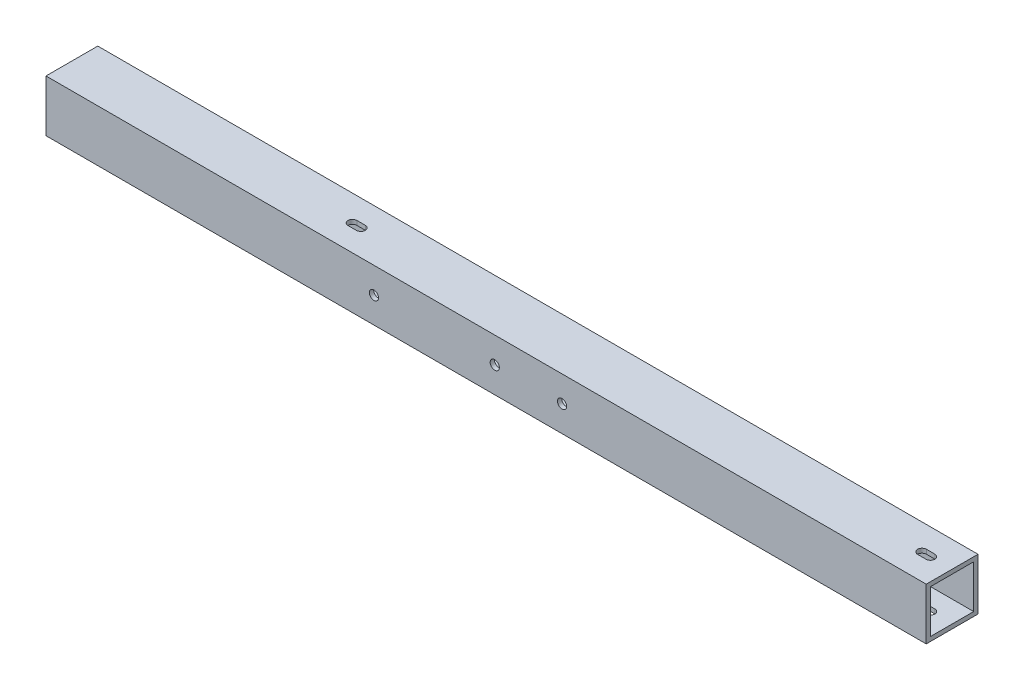
ISO-10303-21;
HEADER;
FILE_DESCRIPTION(('STEP AP214'),'2;1');
FILE_NAME('part.step','',(''),(''),'','','');
FILE_SCHEMA(('AUTOMOTIVE_DESIGN { 1 0 10303 214 1 1 1 1 }'));
ENDSEC;
DATA;
#1=APPLICATION_CONTEXT('core data for automotive mechanical design processes');
#2=APPLICATION_PROTOCOL_DEFINITION('international standard','automotive_design',2000,#1);
#3=PRODUCT_CONTEXT('',#1,'mechanical');
#4=PRODUCT('Part','Part','',(#3));
#5=PRODUCT_RELATED_PRODUCT_CATEGORY('part','',(#4));
#6=PRODUCT_DEFINITION_FORMATION('','',#4);
#7=PRODUCT_DEFINITION_CONTEXT('part definition',#1,'design');
#8=PRODUCT_DEFINITION('design','',#6,#7);
#9=PRODUCT_DEFINITION_SHAPE('','',#8);
#10=(LENGTH_UNIT() NAMED_UNIT(*) SI_UNIT(.MILLI.,.METRE.));
#11=(NAMED_UNIT(*) PLANE_ANGLE_UNIT() SI_UNIT($,.RADIAN.));
#12=(NAMED_UNIT(*) SI_UNIT($,.STERADIAN.) SOLID_ANGLE_UNIT());
#13=UNCERTAINTY_MEASURE_WITH_UNIT(LENGTH_MEASURE(1.E-05),#10,'distance_accuracy_value','');
#14=(GEOMETRIC_REPRESENTATION_CONTEXT(3) GLOBAL_UNCERTAINTY_ASSIGNED_CONTEXT((#13)) GLOBAL_UNIT_ASSIGNED_CONTEXT((#10,
#11,#12)) REPRESENTATION_CONTEXT('',''));
#15=CARTESIAN_POINT('',(0.,0.,0.));
#16=DIRECTION('',(0.,0.,1.));
#17=DIRECTION('',(1.,0.,0.));
#18=AXIS2_PLACEMENT_3D('',#15,#16,#17);
#19=CARTESIAN_POINT('',(-723.9,38.1,-38.1));
#20=DIRECTION('',(0.,-1.,0.));
#21=DIRECTION('',(0.,0.,-1.));
#22=AXIS2_PLACEMENT_3D('',#19,#20,#21);
#23=PLANE('',#22);
#24=DIRECTION('',(1.,0.,0.));
#25=VECTOR('',#24,1.);
#26=CARTESIAN_POINT('',(-479.3361,38.1,-22.3139));
#27=LINE('',#26,#25);
#28=CARTESIAN_POINT('',(-479.3361,38.1,-22.3139));
#29=VERTEX_POINT('',#28);
#30=CARTESIAN_POINT('',(-473.1639,38.1,-22.3139));
#31=VERTEX_POINT('',#30);
#32=EDGE_CURVE('E216',#29,#31,#27,.T.);
#33=ORIENTED_EDGE('',*,*,#32,.T.);
#34=CARTESIAN_POINT('',(-473.1639,38.1,-19.05));
#35=DIRECTION('',(0.,-1.,0.));
#36=DIRECTION('',(0.,0.,-1.));
#37=AXIS2_PLACEMENT_3D('',#34,#35,#36);
#38=CIRCLE('',#37,3.26389999999999);
#39=CARTESIAN_POINT('',(-473.1639,38.1,-15.7861));
#40=VERTEX_POINT('',#39);
#41=EDGE_CURVE('E233',#31,#40,#38,.T.);
#42=ORIENTED_EDGE('',*,*,#41,.T.);
#43=DIRECTION('',(1.,0.,0.));
#44=VECTOR('',#43,1.);
#45=CARTESIAN_POINT('',(-479.3361,38.1,-15.7861));
#46=LINE('',#45,#44);
#47=CARTESIAN_POINT('',(-479.3361,38.1,-15.7861));
#48=VERTEX_POINT('',#47);
#49=EDGE_CURVE('E224',#48,#40,#46,.T.);
#50=ORIENTED_EDGE('',*,*,#49,.F.);
#51=CARTESIAN_POINT('',(-479.3361,38.1,-19.05));
#52=DIRECTION('',(0.,-1.,0.));
#53=DIRECTION('',(0.,0.,-1.));
#54=AXIS2_PLACEMENT_3D('',#51,#52,#53);
#55=CIRCLE('',#54,3.26389999999999);
#56=EDGE_CURVE('E226',#48,#29,#55,.T.);
#57=ORIENTED_EDGE('',*,*,#56,.T.);
#58=EDGE_LOOP('',(#33,#42,#50,#57));
#59=FACE_BOUND('',#58,.T.);
#60=DIRECTION('',(0.,0.,1.));
#61=VECTOR('',#60,1.);
#62=CARTESIAN_POINT('',(-38.1,38.1,-38.1));
#63=LINE('',#62,#61);
#64=CARTESIAN_POINT('',(-38.1,38.1,-38.1));
#65=VERTEX_POINT('',#64);
#66=CARTESIAN_POINT('',(-38.1,38.1,0.));
#67=VERTEX_POINT('',#66);
#68=EDGE_CURVE('E305',#65,#67,#63,.T.);
#69=ORIENTED_EDGE('',*,*,#68,.F.);
#70=DIRECTION('',(1.,0.,0.));
#71=VECTOR('',#70,1.);
#72=CARTESIAN_POINT('',(-723.9,38.1,-38.1));
#73=LINE('',#72,#71);
#74=CARTESIAN_POINT('',(-685.8,38.1,-38.1));
#75=VERTEX_POINT('',#74);
#76=EDGE_CURVE('E342',#75,#65,#73,.T.);
#77=ORIENTED_EDGE('',*,*,#76,.F.);
#78=DIRECTION('',(0.,0.,-1.));
#79=VECTOR('',#78,1.);
#80=CARTESIAN_POINT('',(-685.8,38.1,-38.1));
#81=LINE('',#80,#79);
#82=CARTESIAN_POINT('',(-685.8,38.1,0.));
#83=VERTEX_POINT('',#82);
#84=EDGE_CURVE('E321',#83,#75,#81,.T.);
#85=ORIENTED_EDGE('',*,*,#84,.F.);
#86=DIRECTION('',(1.,0.,0.));
#87=VECTOR('',#86,1.);
#88=CARTESIAN_POINT('',(-723.9,38.1,0.));
#89=LINE('',#88,#87);
#90=EDGE_CURVE('E345',#83,#67,#89,.T.);
#91=ORIENTED_EDGE('',*,*,#90,.T.);
#92=EDGE_LOOP('',(#69,#77,#85,#91));
#93=FACE_BOUND('',#92,.T.);
#94=DIRECTION('',(1.,0.,0.));
#95=VECTOR('',#94,1.);
#96=CARTESIAN_POINT('',(-60.2361,38.1,-15.7861));
#97=LINE('',#96,#95);
#98=CARTESIAN_POINT('',(-60.2361,38.1,-15.7861));
#99=VERTEX_POINT('',#98);
#100=CARTESIAN_POINT('',(-54.0639,38.1,-15.7861));
#101=VERTEX_POINT('',#100);
#102=EDGE_CURVE('E248',#99,#101,#97,.T.);
#103=ORIENTED_EDGE('',*,*,#102,.F.);
#104=CARTESIAN_POINT('',(-60.2361,38.1,-19.05));
#105=DIRECTION('',(0.,-1.,0.));
#106=DIRECTION('',(0.,0.,-1.));
#107=AXIS2_PLACEMENT_3D('',#104,#105,#106);
#108=CIRCLE('',#107,3.26389999999999);
#109=CARTESIAN_POINT('',(-60.2361,38.1,-22.3139));
#110=VERTEX_POINT('',#109);
#111=EDGE_CURVE('E250',#99,#110,#108,.T.);
#112=ORIENTED_EDGE('',*,*,#111,.T.);
#113=DIRECTION('',(1.,0.,0.));
#114=VECTOR('',#113,1.);
#115=CARTESIAN_POINT('',(-60.2361,38.1,-22.3139));
#116=LINE('',#115,#114);
#117=CARTESIAN_POINT('',(-54.0639,38.1,-22.3139));
#118=VERTEX_POINT('',#117);
#119=EDGE_CURVE('E244',#110,#118,#116,.T.);
#120=ORIENTED_EDGE('',*,*,#119,.T.);
#121=CARTESIAN_POINT('',(-54.0639,38.1,-19.05));
#122=DIRECTION('',(0.,-1.,0.));
#123=DIRECTION('',(0.,0.,-1.));
#124=AXIS2_PLACEMENT_3D('',#121,#122,#123);
#125=CIRCLE('',#124,3.26389999999999);
#126=EDGE_CURVE('E251',#118,#101,#125,.T.);
#127=ORIENTED_EDGE('',*,*,#126,.T.);
#128=EDGE_LOOP('',(#103,#112,#120,#127));
#129=FACE_BOUND('',#128,.T.);
#130=ADVANCED_FACE('F33',(#59,#93,#129),#23,.F.);
#131=CARTESIAN_POINT('',(-723.9,0.,-38.1));
#132=DIRECTION('',(0.,1.,0.));
#133=DIRECTION('',(0.,0.,1.));
#134=AXIS2_PLACEMENT_3D('',#131,#132,#133);
#135=PLANE('',#134);
#136=CARTESIAN_POINT('',(-473.1639,0.,-19.05));
#137=DIRECTION('',(0.,-1.,0.));
#138=DIRECTION('',(0.,0.,-1.));
#139=AXIS2_PLACEMENT_3D('',#136,#137,#138);
#140=CIRCLE('',#139,3.26389999999999);
#141=CARTESIAN_POINT('',(-473.1639,0.,-22.3139));
#142=VERTEX_POINT('',#141);
#143=CARTESIAN_POINT('',(-473.1639,0.,-15.7861));
#144=VERTEX_POINT('',#143);
#145=EDGE_CURVE('E205',#142,#144,#140,.T.);
#146=ORIENTED_EDGE('',*,*,#145,.F.);
#147=DIRECTION('',(1.,0.,0.));
#148=VECTOR('',#147,1.);
#149=CARTESIAN_POINT('',(-479.3361,0.,-22.3139));
#150=LINE('',#149,#148);
#151=CARTESIAN_POINT('',(-479.3361,0.,-22.3139));
#152=VERTEX_POINT('',#151);
#153=EDGE_CURVE('E221',#152,#142,#150,.T.);
#154=ORIENTED_EDGE('',*,*,#153,.F.);
#155=CARTESIAN_POINT('',(-479.3361,0.,-19.05));
#156=DIRECTION('',(0.,-1.,0.));
#157=DIRECTION('',(0.,0.,-1.));
#158=AXIS2_PLACEMENT_3D('',#155,#156,#157);
#159=CIRCLE('',#158,3.26389999999999);
#160=CARTESIAN_POINT('',(-479.3361,0.,-15.7861));
#161=VERTEX_POINT('',#160);
#162=EDGE_CURVE('E215',#161,#152,#159,.T.);
#163=ORIENTED_EDGE('',*,*,#162,.F.);
#164=DIRECTION('',(1.,0.,0.));
#165=VECTOR('',#164,1.);
#166=CARTESIAN_POINT('',(-479.3361,0.,-15.7861));
#167=LINE('',#166,#165);
#168=EDGE_CURVE('E199',#161,#144,#167,.T.);
#169=ORIENTED_EDGE('',*,*,#168,.T.);
#170=EDGE_LOOP('',(#146,#154,#163,#169));
#171=FACE_BOUND('',#170,.T.);
#172=CARTESIAN_POINT('',(-54.0639,0.,-19.05));
#173=DIRECTION('',(0.,-1.,0.));
#174=DIRECTION('',(0.,0.,-1.));
#175=AXIS2_PLACEMENT_3D('',#172,#173,#174);
#176=CIRCLE('',#175,3.26389999999999);
#177=CARTESIAN_POINT('',(-54.0639,0.,-22.3139));
#178=VERTEX_POINT('',#177);
#179=CARTESIAN_POINT('',(-54.0639000000001,0.,-15.7861));
#180=VERTEX_POINT('',#179);
#181=EDGE_CURVE('E268',#178,#180,#176,.T.);
#182=ORIENTED_EDGE('',*,*,#181,.F.);
#183=DIRECTION('',(1.,0.,0.));
#184=VECTOR('',#183,1.);
#185=CARTESIAN_POINT('',(-60.2361,0.,-22.3139));
#186=LINE('',#185,#184);
#187=CARTESIAN_POINT('',(-60.2361,0.,-22.3139));
#188=VERTEX_POINT('',#187);
#189=EDGE_CURVE('E242',#188,#178,#186,.T.);
#190=ORIENTED_EDGE('',*,*,#189,.F.);
#191=CARTESIAN_POINT('',(-60.2361,0.,-19.05));
#192=DIRECTION('',(0.,-1.,0.));
#193=DIRECTION('',(0.,0.,-1.));
#194=AXIS2_PLACEMENT_3D('',#191,#192,#193);
#195=CIRCLE('',#194,3.26389999999999);
#196=CARTESIAN_POINT('',(-60.2361,0.,-15.7861));
#197=VERTEX_POINT('',#196);
#198=EDGE_CURVE('E254',#197,#188,#195,.T.);
#199=ORIENTED_EDGE('',*,*,#198,.F.);
#200=DIRECTION('',(1.,0.,0.));
#201=VECTOR('',#200,1.);
#202=CARTESIAN_POINT('',(-60.2361,0.,-15.7861));
#203=LINE('',#202,#201);
#204=EDGE_CURVE('E247',#197,#180,#203,.T.);
#205=ORIENTED_EDGE('',*,*,#204,.T.);
#206=EDGE_LOOP('',(#182,#190,#199,#205));
#207=FACE_BOUND('',#206,.T.);
#208=DIRECTION('',(0.,0.,-1.));
#209=VECTOR('',#208,1.);
#210=CARTESIAN_POINT('',(-38.1,0.,-38.1));
#211=LINE('',#210,#209);
#212=CARTESIAN_POINT('',(-38.1,0.,0.));
#213=VERTEX_POINT('',#212);
#214=CARTESIAN_POINT('',(-38.1,0.,-38.1));
#215=VERTEX_POINT('',#214);
#216=EDGE_CURVE('E303',#213,#215,#211,.T.);
#217=ORIENTED_EDGE('',*,*,#216,.F.);
#218=DIRECTION('',(1.,0.,0.));
#219=VECTOR('',#218,1.);
#220=CARTESIAN_POINT('',(-723.9,0.,0.));
#221=LINE('',#220,#219);
#222=CARTESIAN_POINT('',(-685.8,0.,0.));
#223=VERTEX_POINT('',#222);
#224=EDGE_CURVE('E330',#223,#213,#221,.T.);
#225=ORIENTED_EDGE('',*,*,#224,.F.);
#226=DIRECTION('',(0.,0.,1.));
#227=VECTOR('',#226,1.);
#228=CARTESIAN_POINT('',(-685.8,0.,-38.1));
#229=LINE('',#228,#227);
#230=CARTESIAN_POINT('',(-685.8,0.,-38.1));
#231=VERTEX_POINT('',#230);
#232=EDGE_CURVE('E323',#231,#223,#229,.T.);
#233=ORIENTED_EDGE('',*,*,#232,.F.);
#234=DIRECTION('',(1.,0.,0.));
#235=VECTOR('',#234,1.);
#236=CARTESIAN_POINT('',(-723.9,0.,-38.1));
#237=LINE('',#236,#235);
#238=EDGE_CURVE('E325',#231,#215,#237,.T.);
#239=ORIENTED_EDGE('',*,*,#238,.T.);
#240=EDGE_LOOP('',(#217,#225,#233,#239));
#241=FACE_BOUND('',#240,.T.);
#242=ADVANCED_FACE('F35',(#171,#207,#241),#135,.F.);
#243=CARTESIAN_POINT('',(-723.9,38.1,0.));
#244=DIRECTION('',(0.,0.,-1.));
#245=DIRECTION('',(-1.,0.,0.));
#246=AXIS2_PLACEMENT_3D('',#243,#244,#245);
#247=PLANE('',#246);
#248=CARTESIAN_POINT('',(-355.6,19.05,0.));
#249=DIRECTION('',(0.,0.,-1.));
#250=DIRECTION('',(-1.,0.,0.));
#251=AXIS2_PLACEMENT_3D('',#248,#249,#250);
#252=CIRCLE('',#251,3.3782);
#253=CARTESIAN_POINT('',(-358.9782,19.05,0.));
#254=VERTEX_POINT('',#253);
#255=EDGE_CURVE('E409',#254,#254,#252,.T.);
#256=ORIENTED_EDGE('',*,*,#255,.T.);
#257=EDGE_LOOP('',(#256));
#258=FACE_BOUND('',#257,.T.);
#259=CARTESIAN_POINT('',(-444.5,19.05,0.));
#260=DIRECTION('',(0.,0.,-1.));
#261=DIRECTION('',(-1.,0.,0.));
#262=AXIS2_PLACEMENT_3D('',#259,#260,#261);
#263=CIRCLE('',#262,3.3782);
#264=CARTESIAN_POINT('',(-447.8782,19.05,0.));
#265=VERTEX_POINT('',#264);
#266=EDGE_CURVE('E397',#265,#265,#263,.T.);
#267=ORIENTED_EDGE('',*,*,#266,.T.);
#268=EDGE_LOOP('',(#267));
#269=FACE_BOUND('',#268,.T.);
#270=CARTESIAN_POINT('',(-306.07,19.05,0.));
#271=DIRECTION('',(0.,0.,1.));
#272=DIRECTION('',(1.,0.,0.));
#273=AXIS2_PLACEMENT_3D('',#270,#271,#272);
#274=CIRCLE('',#273,3.3782);
#275=CARTESIAN_POINT('',(-302.6918,19.05,0.));
#276=VERTEX_POINT('',#275);
#277=EDGE_CURVE('E391',#276,#276,#274,.T.);
#278=ORIENTED_EDGE('',*,*,#277,.F.);
#279=EDGE_LOOP('',(#278));
#280=FACE_BOUND('',#279,.T.);
#281=DIRECTION('',(0.,1.,0.));
#282=VECTOR('',#281,1.);
#283=CARTESIAN_POINT('',(-38.1,0.,0.));
#284=LINE('',#283,#282);
#285=EDGE_CURVE('E291',#213,#67,#284,.T.);
#286=ORIENTED_EDGE('',*,*,#285,.T.);
#287=ORIENTED_EDGE('',*,*,#90,.F.);
#288=DIRECTION('',(0.,-1.,0.));
#289=VECTOR('',#288,1.);
#290=CARTESIAN_POINT('',(-685.8,596.9,0.));
#291=LINE('',#290,#289);
#292=EDGE_CURVE('E309',#83,#223,#291,.T.);
#293=ORIENTED_EDGE('',*,*,#292,.T.);
#294=ORIENTED_EDGE('',*,*,#224,.T.);
#295=EDGE_LOOP('',(#286,#287,#293,#294));
#296=FACE_BOUND('',#295,.T.);
#297=ADVANCED_FACE('F422',(#258,#269,#280,#296),#247,.F.);
#298=CARTESIAN_POINT('',(-723.9,38.1,-38.1));
#299=DIRECTION('',(0.,0.,1.));
#300=DIRECTION('',(1.,0.,0.));
#301=AXIS2_PLACEMENT_3D('',#298,#299,#300);
#302=PLANE('',#301);
#303=CARTESIAN_POINT('',(-355.6,19.05,-38.1));
#304=DIRECTION('',(0.,0.,-1.));
#305=DIRECTION('',(-1.,0.,0.));
#306=AXIS2_PLACEMENT_3D('',#303,#304,#305);
#307=CIRCLE('',#306,3.3782);
#308=CARTESIAN_POINT('',(-358.9782,19.05,-38.1));
#309=VERTEX_POINT('',#308);
#310=EDGE_CURVE('E412',#309,#309,#307,.T.);
#311=ORIENTED_EDGE('',*,*,#310,.F.);
#312=EDGE_LOOP('',(#311));
#313=FACE_BOUND('',#312,.T.);
#314=CARTESIAN_POINT('',(-444.5,19.05,-38.1));
#315=DIRECTION('',(0.,0.,-1.));
#316=DIRECTION('',(-1.,0.,0.));
#317=AXIS2_PLACEMENT_3D('',#314,#315,#316);
#318=CIRCLE('',#317,3.3782);
#319=CARTESIAN_POINT('',(-447.8782,19.05,-38.1));
#320=VERTEX_POINT('',#319);
#321=EDGE_CURVE('E400',#320,#320,#318,.T.);
#322=ORIENTED_EDGE('',*,*,#321,.F.);
#323=EDGE_LOOP('',(#322));
#324=FACE_BOUND('',#323,.T.);
#325=CARTESIAN_POINT('',(-306.07,19.05,-38.1));
#326=DIRECTION('',(0.,0.,1.));
#327=DIRECTION('',(1.,0.,0.));
#328=AXIS2_PLACEMENT_3D('',#325,#326,#327);
#329=CIRCLE('',#328,3.3782);
#330=CARTESIAN_POINT('',(-302.6918,19.05,-38.1));
#331=VERTEX_POINT('',#330);
#332=EDGE_CURVE('E388',#331,#331,#329,.T.);
#333=ORIENTED_EDGE('',*,*,#332,.T.);
#334=EDGE_LOOP('',(#333));
#335=FACE_BOUND('',#334,.T.);
#336=DIRECTION('',(0.,1.,0.));
#337=VECTOR('',#336,1.);
#338=CARTESIAN_POINT('',(-38.1,0.,-38.1));
#339=LINE('',#338,#337);
#340=EDGE_CURVE('E289',#215,#65,#339,.T.);
#341=ORIENTED_EDGE('',*,*,#340,.F.);
#342=ORIENTED_EDGE('',*,*,#238,.F.);
#343=DIRECTION('',(0.,-1.,0.));
#344=VECTOR('',#343,1.);
#345=CARTESIAN_POINT('',(-685.8,596.9,-38.1));
#346=LINE('',#345,#344);
#347=EDGE_CURVE('E307',#75,#231,#346,.T.);
#348=ORIENTED_EDGE('',*,*,#347,.F.);
#349=ORIENTED_EDGE('',*,*,#76,.T.);
#350=EDGE_LOOP('',(#341,#342,#348,#349));
#351=FACE_BOUND('',#350,.T.);
#352=ADVANCED_FACE('F418',(#313,#324,#335,#351),#302,.F.);
#353=CARTESIAN_POINT('',(-685.8,596.9,-38.1));
#354=DIRECTION('',(-1.,0.,0.));
#355=DIRECTION('',(0.,0.,1.));
#356=AXIS2_PLACEMENT_3D('',#353,#354,#355);
#357=PLANE('',#356);
#358=DIRECTION('',(0.,-1.,0.));
#359=VECTOR('',#358,1.);
#360=CARTESIAN_POINT('',(-685.8,34.925,-34.925));
#361=LINE('',#360,#359);
#362=CARTESIAN_POINT('',(-685.8,34.925,-34.925));
#363=VERTEX_POINT('',#362);
#364=CARTESIAN_POINT('',(-685.8,3.175,-34.925));
#365=VERTEX_POINT('',#364);
#366=EDGE_CURVE('E315',#363,#365,#361,.T.);
#367=ORIENTED_EDGE('',*,*,#366,.F.);
#368=DIRECTION('',(0.,0.,-1.));
#369=VECTOR('',#368,1.);
#370=CARTESIAN_POINT('',(-685.8,34.925,-34.925));
#371=LINE('',#370,#369);
#372=CARTESIAN_POINT('',(-685.8,34.925,-3.175));
#373=VERTEX_POINT('',#372);
#374=EDGE_CURVE('E312',#373,#363,#371,.T.);
#375=ORIENTED_EDGE('',*,*,#374,.F.);
#376=DIRECTION('',(0.,1.,0.));
#377=VECTOR('',#376,1.);
#378=CARTESIAN_POINT('',(-685.8,34.925,-3.175));
#379=LINE('',#378,#377);
#380=CARTESIAN_POINT('',(-685.8,3.175,-3.175));
#381=VERTEX_POINT('',#380);
#382=EDGE_CURVE('E339',#381,#373,#379,.T.);
#383=ORIENTED_EDGE('',*,*,#382,.F.);
#384=DIRECTION('',(0.,0.,1.));
#385=VECTOR('',#384,1.);
#386=CARTESIAN_POINT('',(-685.8,3.175,-34.925));
#387=LINE('',#386,#385);
#388=EDGE_CURVE('E318',#365,#381,#387,.T.);
#389=ORIENTED_EDGE('',*,*,#388,.F.);
#390=EDGE_LOOP('',(#367,#375,#383,#389));
#391=FACE_BOUND('',#390,.T.);
#392=ORIENTED_EDGE('',*,*,#232,.T.);
#393=ORIENTED_EDGE('',*,*,#292,.F.);
#394=ORIENTED_EDGE('',*,*,#84,.T.);
#395=ORIENTED_EDGE('',*,*,#347,.T.);
#396=EDGE_LOOP('',(#392,#393,#394,#395));
#397=FACE_BOUND('',#396,.T.);
#398=ADVANCED_FACE('F421',(#391,#397),#357,.T.);
#399=CARTESIAN_POINT('',(-723.9,3.175,-34.925));
#400=DIRECTION('',(0.,1.,0.));
#401=DIRECTION('',(0.,0.,1.));
#402=AXIS2_PLACEMENT_3D('',#399,#400,#401);
#403=PLANE('',#402);
#404=CARTESIAN_POINT('',(-473.1639,3.175,-19.05));
#405=DIRECTION('',(0.,1.,0.));
#406=DIRECTION('',(0.,0.,1.));
#407=AXIS2_PLACEMENT_3D('',#404,#405,#406);
#408=CIRCLE('',#407,3.26389999999999);
#409=CARTESIAN_POINT('',(-473.1639,3.175,-15.7861));
#410=VERTEX_POINT('',#409);
#411=CARTESIAN_POINT('',(-473.1639,3.175,-22.3139));
#412=VERTEX_POINT('',#411);
#413=EDGE_CURVE('E240',#410,#412,#408,.T.);
#414=ORIENTED_EDGE('',*,*,#413,.F.);
#415=DIRECTION('',(1.,0.,0.));
#416=VECTOR('',#415,1.);
#417=CARTESIAN_POINT('',(-723.9,3.175,-15.7861));
#418=LINE('',#417,#416);
#419=CARTESIAN_POINT('',(-479.3361,3.175,-15.7861));
#420=VERTEX_POINT('',#419);
#421=EDGE_CURVE('E11',#420,#410,#418,.T.);
#422=ORIENTED_EDGE('',*,*,#421,.F.);
#423=CARTESIAN_POINT('',(-479.3361,3.175,-19.05));
#424=DIRECTION('',(0.,1.,0.));
#425=DIRECTION('',(0.,0.,1.));
#426=AXIS2_PLACEMENT_3D('',#423,#424,#425);
#427=CIRCLE('',#426,3.26389999999999);
#428=CARTESIAN_POINT('',(-479.3361,3.175,-22.3139));
#429=VERTEX_POINT('',#428);
#430=EDGE_CURVE('E42',#429,#420,#427,.T.);
#431=ORIENTED_EDGE('',*,*,#430,.F.);
#432=DIRECTION('',(-1.,0.,0.));
#433=VECTOR('',#432,1.);
#434=CARTESIAN_POINT('',(-723.9,3.175,-22.3139));
#435=LINE('',#434,#433);
#436=EDGE_CURVE('E229',#412,#429,#435,.T.);
#437=ORIENTED_EDGE('',*,*,#436,.F.);
#438=EDGE_LOOP('',(#414,#422,#431,#437));
#439=FACE_BOUND('',#438,.T.);
#440=CARTESIAN_POINT('',(-54.0639,3.175,-19.05));
#441=DIRECTION('',(0.,1.,0.));
#442=DIRECTION('',(0.,0.,1.));
#443=AXIS2_PLACEMENT_3D('',#440,#441,#442);
#444=CIRCLE('',#443,3.26389999999999);
#445=CARTESIAN_POINT('',(-54.0639,3.175,-15.7861));
#446=VERTEX_POINT('',#445);
#447=CARTESIAN_POINT('',(-54.0639,3.175,-22.3139));
#448=VERTEX_POINT('',#447);
#449=EDGE_CURVE('E285',#446,#448,#444,.T.);
#450=ORIENTED_EDGE('',*,*,#449,.F.);
#451=DIRECTION('',(1.,0.,0.));
#452=VECTOR('',#451,1.);
#453=CARTESIAN_POINT('',(-723.9,3.175,-15.7861));
#454=LINE('',#453,#452);
#455=CARTESIAN_POINT('',(-60.2361,3.175,-15.7861));
#456=VERTEX_POINT('',#455);
#457=EDGE_CURVE('E281',#456,#446,#454,.T.);
#458=ORIENTED_EDGE('',*,*,#457,.F.);
#459=CARTESIAN_POINT('',(-60.2361,3.175,-19.05));
#460=DIRECTION('',(0.,1.,0.));
#461=DIRECTION('',(0.,0.,1.));
#462=AXIS2_PLACEMENT_3D('',#459,#460,#461);
#463=CIRCLE('',#462,3.26389999999999);
#464=CARTESIAN_POINT('',(-60.2361,3.175,-22.3139));
#465=VERTEX_POINT('',#464);
#466=EDGE_CURVE('E355',#465,#456,#463,.T.);
#467=ORIENTED_EDGE('',*,*,#466,.F.);
#468=DIRECTION('',(-1.,0.,0.));
#469=VECTOR('',#468,1.);
#470=CARTESIAN_POINT('',(-723.9,3.175,-22.3139));
#471=LINE('',#470,#469);
#472=EDGE_CURVE('E357',#448,#465,#471,.T.);
#473=ORIENTED_EDGE('',*,*,#472,.F.);
#474=EDGE_LOOP('',(#450,#458,#467,#473));
#475=FACE_BOUND('',#474,.T.);
#476=DIRECTION('',(1.,0.,0.));
#477=VECTOR('',#476,1.);
#478=CARTESIAN_POINT('',(-723.9,3.175,-3.175));
#479=LINE('',#478,#477);
#480=CARTESIAN_POINT('',(-38.1,3.175,-3.175));
#481=VERTEX_POINT('',#480);
#482=EDGE_CURVE('E326',#381,#481,#479,.T.);
#483=ORIENTED_EDGE('',*,*,#482,.T.);
#484=DIRECTION('',(0.,0.,-1.));
#485=VECTOR('',#484,1.);
#486=CARTESIAN_POINT('',(-38.1,3.175,-34.925));
#487=LINE('',#486,#485);
#488=CARTESIAN_POINT('',(-38.1,3.175,-34.925));
#489=VERTEX_POINT('',#488);
#490=EDGE_CURVE('E352',#481,#489,#487,.T.);
#491=ORIENTED_EDGE('',*,*,#490,.T.);
#492=DIRECTION('',(1.,0.,0.));
#493=VECTOR('',#492,1.);
#494=CARTESIAN_POINT('',(-723.9,3.175,-34.925));
#495=LINE('',#494,#493);
#496=EDGE_CURVE('E336',#365,#489,#495,.T.);
#497=ORIENTED_EDGE('',*,*,#496,.F.);
#498=ORIENTED_EDGE('',*,*,#388,.T.);
#499=EDGE_LOOP('',(#483,#491,#497,#498));
#500=FACE_BOUND('',#499,.T.);
#501=ADVANCED_FACE('F377',(#439,#475,#500),#403,.T.);
#502=CARTESIAN_POINT('',(-723.9,34.925,-34.925));
#503=DIRECTION('',(0.,0.,1.));
#504=DIRECTION('',(1.,0.,0.));
#505=AXIS2_PLACEMENT_3D('',#502,#503,#504);
#506=PLANE('',#505);
#507=CARTESIAN_POINT('',(-355.6,19.05,-34.925));
#508=DIRECTION('',(0.,0.,1.));
#509=DIRECTION('',(1.,0.,0.));
#510=AXIS2_PLACEMENT_3D('',#507,#508,#509);
#511=CIRCLE('',#510,3.3782);
#512=CARTESIAN_POINT('',(-352.2218,19.05,-34.925));
#513=VERTEX_POINT('',#512);
#514=EDGE_CURVE('E403',#513,#513,#511,.T.);
#515=ORIENTED_EDGE('',*,*,#514,.F.);
#516=EDGE_LOOP('',(#515));
#517=FACE_BOUND('',#516,.T.);
#518=CARTESIAN_POINT('',(-444.5,19.05,-34.925));
#519=DIRECTION('',(0.,0.,1.));
#520=DIRECTION('',(1.,0.,0.));
#521=AXIS2_PLACEMENT_3D('',#518,#519,#520);
#522=CIRCLE('',#521,3.3782);
#523=CARTESIAN_POINT('',(-441.1218,19.05,-34.925));
#524=VERTEX_POINT('',#523);
#525=EDGE_CURVE('E394',#524,#524,#522,.T.);
#526=ORIENTED_EDGE('',*,*,#525,.F.);
#527=EDGE_LOOP('',(#526));
#528=FACE_BOUND('',#527,.T.);
#529=CARTESIAN_POINT('',(-306.07,19.05,-34.925));
#530=DIRECTION('',(0.,0.,1.));
#531=DIRECTION('',(1.,0.,0.));
#532=AXIS2_PLACEMENT_3D('',#529,#530,#531);
#533=CIRCLE('',#532,3.3782);
#534=CARTESIAN_POINT('',(-302.6918,19.05,-34.925));
#535=VERTEX_POINT('',#534);
#536=EDGE_CURVE('E383',#535,#535,#533,.T.);
#537=ORIENTED_EDGE('',*,*,#536,.F.);
#538=EDGE_LOOP('',(#537));
#539=FACE_BOUND('',#538,.T.);
#540=ORIENTED_EDGE('',*,*,#496,.T.);
#541=DIRECTION('',(0.,1.,0.));
#542=VECTOR('',#541,1.);
#543=CARTESIAN_POINT('',(-38.1,34.925,-34.925));
#544=LINE('',#543,#542);
#545=CARTESIAN_POINT('',(-38.1,34.925,-34.925));
#546=VERTEX_POINT('',#545);
#547=EDGE_CURVE('E294',#489,#546,#544,.T.);
#548=ORIENTED_EDGE('',*,*,#547,.T.);
#549=DIRECTION('',(1.,0.,0.));
#550=VECTOR('',#549,1.);
#551=CARTESIAN_POINT('',(-723.9,34.925,-34.925));
#552=LINE('',#551,#550);
#553=EDGE_CURVE('E333',#363,#546,#552,.T.);
#554=ORIENTED_EDGE('',*,*,#553,.F.);
#555=ORIENTED_EDGE('',*,*,#366,.T.);
#556=EDGE_LOOP('',(#540,#548,#554,#555));
#557=FACE_BOUND('',#556,.T.);
#558=ADVANCED_FACE('F545',(#517,#528,#539,#557),#506,.T.);
#559=CARTESIAN_POINT('',(-723.9,34.925,-34.925));
#560=DIRECTION('',(0.,-1.,0.));
#561=DIRECTION('',(0.,0.,-1.));
#562=AXIS2_PLACEMENT_3D('',#559,#560,#561);
#563=PLANE('',#562);
#564=DIRECTION('',(-1.,0.,0.));
#565=VECTOR('',#564,1.);
#566=CARTESIAN_POINT('',(-723.9,34.925,-15.7861));
#567=LINE('',#566,#565);
#568=CARTESIAN_POINT('',(-473.1639,34.925,-15.7861));
#569=VERTEX_POINT('',#568);
#570=CARTESIAN_POINT('',(-479.3361,34.925,-15.7861));
#571=VERTEX_POINT('',#570);
#572=EDGE_CURVE('E369',#569,#571,#567,.T.);
#573=ORIENTED_EDGE('',*,*,#572,.F.);
#574=CARTESIAN_POINT('',(-473.1639,34.925,-19.05));
#575=DIRECTION('',(0.,-1.,0.));
#576=DIRECTION('',(0.,0.,-1.));
#577=AXIS2_PLACEMENT_3D('',#574,#575,#576);
#578=CIRCLE('',#577,3.26389999999999);
#579=CARTESIAN_POINT('',(-473.1639,34.925,-22.3139));
#580=VERTEX_POINT('',#579);
#581=EDGE_CURVE('E365',#580,#569,#578,.T.);
#582=ORIENTED_EDGE('',*,*,#581,.F.);
#583=DIRECTION('',(1.,0.,0.));
#584=VECTOR('',#583,1.);
#585=CARTESIAN_POINT('',(-723.9,34.925,-22.3139));
#586=LINE('',#585,#584);
#587=CARTESIAN_POINT('',(-479.3361,34.925,-22.3139));
#588=VERTEX_POINT('',#587);
#589=EDGE_CURVE('E363',#588,#580,#586,.T.);
#590=ORIENTED_EDGE('',*,*,#589,.F.);
#591=CARTESIAN_POINT('',(-479.3361,34.925,-19.05));
#592=DIRECTION('',(0.,-1.,0.));
#593=DIRECTION('',(0.,0.,-1.));
#594=AXIS2_PLACEMENT_3D('',#591,#592,#593);
#595=CIRCLE('',#594,3.26389999999999);
#596=EDGE_CURVE('E367',#571,#588,#595,.T.);
#597=ORIENTED_EDGE('',*,*,#596,.F.);
#598=EDGE_LOOP('',(#573,#582,#590,#597));
#599=FACE_BOUND('',#598,.T.);
#600=CARTESIAN_POINT('',(-60.2361,34.925,-19.05));
#601=DIRECTION('',(0.,-1.,0.));
#602=DIRECTION('',(0.,0.,-1.));
#603=AXIS2_PLACEMENT_3D('',#600,#601,#602);
#604=CIRCLE('',#603,3.26389999999999);
#605=CARTESIAN_POINT('',(-60.2361,34.925,-15.7861));
#606=VERTEX_POINT('',#605);
#607=CARTESIAN_POINT('',(-60.2361,34.925,-22.3139));
#608=VERTEX_POINT('',#607);
#609=EDGE_CURVE('E287',#606,#608,#604,.T.);
#610=ORIENTED_EDGE('',*,*,#609,.F.);
#611=DIRECTION('',(-1.,0.,0.));
#612=VECTOR('',#611,1.);
#613=CARTESIAN_POINT('',(-723.9,34.925,-15.7861));
#614=LINE('',#613,#612);
#615=CARTESIAN_POINT('',(-54.0639,34.925,-15.7861));
#616=VERTEX_POINT('',#615);
#617=EDGE_CURVE('E260',#616,#606,#614,.T.);
#618=ORIENTED_EDGE('',*,*,#617,.F.);
#619=CARTESIAN_POINT('',(-54.0639,34.925,-19.05));
#620=DIRECTION('',(0.,-1.,0.));
#621=DIRECTION('',(0.,0.,-1.));
#622=AXIS2_PLACEMENT_3D('',#619,#620,#621);
#623=CIRCLE('',#622,3.26389999999999);
#624=CARTESIAN_POINT('',(-54.0639,34.925,-22.3139));
#625=VERTEX_POINT('',#624);
#626=EDGE_CURVE('E283',#625,#616,#623,.T.);
#627=ORIENTED_EDGE('',*,*,#626,.F.);
#628=DIRECTION('',(1.,0.,0.));
#629=VECTOR('',#628,1.);
#630=CARTESIAN_POINT('',(-723.9,34.925,-22.3139));
#631=LINE('',#630,#629);
#632=EDGE_CURVE('E360',#608,#625,#631,.T.);
#633=ORIENTED_EDGE('',*,*,#632,.F.);
#634=EDGE_LOOP('',(#610,#618,#627,#633));
#635=FACE_BOUND('',#634,.T.);
#636=ORIENTED_EDGE('',*,*,#553,.T.);
#637=DIRECTION('',(0.,0.,1.));
#638=VECTOR('',#637,1.);
#639=CARTESIAN_POINT('',(-38.1,34.925,-34.925));
#640=LINE('',#639,#638);
#641=CARTESIAN_POINT('',(-38.1,34.925,-3.175));
#642=VERTEX_POINT('',#641);
#643=EDGE_CURVE('E297',#546,#642,#640,.T.);
#644=ORIENTED_EDGE('',*,*,#643,.T.);
#645=DIRECTION('',(1.,0.,0.));
#646=VECTOR('',#645,1.);
#647=CARTESIAN_POINT('',(-723.9,34.925,-3.175));
#648=LINE('',#647,#646);
#649=EDGE_CURVE('E329',#373,#642,#648,.T.);
#650=ORIENTED_EDGE('',*,*,#649,.F.);
#651=ORIENTED_EDGE('',*,*,#374,.T.);
#652=EDGE_LOOP('',(#636,#644,#650,#651));
#653=FACE_BOUND('',#652,.T.);
#654=ADVANCED_FACE('F458',(#599,#635,#653),#563,.T.);
#655=CARTESIAN_POINT('',(-723.9,34.925,-3.175));
#656=DIRECTION('',(0.,0.,-1.));
#657=DIRECTION('',(-1.,0.,0.));
#658=AXIS2_PLACEMENT_3D('',#655,#656,#657);
#659=PLANE('',#658);
#660=CARTESIAN_POINT('',(-355.6,19.05,-3.175));
#661=DIRECTION('',(0.,0.,-1.));
#662=DIRECTION('',(-1.,0.,0.));
#663=AXIS2_PLACEMENT_3D('',#660,#661,#662);
#664=CIRCLE('',#663,3.3782);
#665=CARTESIAN_POINT('',(-358.9782,19.05,-3.175));
#666=VERTEX_POINT('',#665);
#667=EDGE_CURVE('E406',#666,#666,#664,.T.);
#668=ORIENTED_EDGE('',*,*,#667,.F.);
#669=EDGE_LOOP('',(#668));
#670=FACE_BOUND('',#669,.T.);
#671=CARTESIAN_POINT('',(-444.5,19.05,-3.175));
#672=DIRECTION('',(0.,0.,-1.));
#673=DIRECTION('',(-1.,0.,0.));
#674=AXIS2_PLACEMENT_3D('',#671,#672,#673);
#675=CIRCLE('',#674,3.3782);
#676=CARTESIAN_POINT('',(-447.8782,19.05,-3.175));
#677=VERTEX_POINT('',#676);
#678=EDGE_CURVE('E37',#677,#677,#675,.T.);
#679=ORIENTED_EDGE('',*,*,#678,.F.);
#680=EDGE_LOOP('',(#679));
#681=FACE_BOUND('',#680,.T.);
#682=CARTESIAN_POINT('',(-306.07,19.05,-3.175));
#683=DIRECTION('',(0.,0.,-1.));
#684=DIRECTION('',(-1.,0.,0.));
#685=AXIS2_PLACEMENT_3D('',#682,#683,#684);
#686=CIRCLE('',#685,3.3782);
#687=CARTESIAN_POINT('',(-309.4482,19.05,-3.175));
#688=VERTEX_POINT('',#687);
#689=EDGE_CURVE('E380',#688,#688,#686,.T.);
#690=ORIENTED_EDGE('',*,*,#689,.F.);
#691=EDGE_LOOP('',(#690));
#692=FACE_BOUND('',#691,.T.);
#693=ORIENTED_EDGE('',*,*,#649,.T.);
#694=DIRECTION('',(0.,-1.,0.));
#695=VECTOR('',#694,1.);
#696=CARTESIAN_POINT('',(-38.1,34.925,-3.175));
#697=LINE('',#696,#695);
#698=EDGE_CURVE('E300',#642,#481,#697,.T.);
#699=ORIENTED_EDGE('',*,*,#698,.T.);
#700=ORIENTED_EDGE('',*,*,#482,.F.);
#701=ORIENTED_EDGE('',*,*,#382,.T.);
#702=EDGE_LOOP('',(#693,#699,#700,#701));
#703=FACE_BOUND('',#702,.T.);
#704=ADVANCED_FACE('F447',(#670,#681,#692,#703),#659,.T.);
#705=CARTESIAN_POINT('',(-38.1,0.,-38.1));
#706=DIRECTION('',(1.,0.,0.));
#707=DIRECTION('',(0.,1.,0.));
#708=AXIS2_PLACEMENT_3D('',#705,#706,#707);
#709=PLANE('',#708);
#710=ORIENTED_EDGE('',*,*,#643,.F.);
#711=ORIENTED_EDGE('',*,*,#547,.F.);
#712=ORIENTED_EDGE('',*,*,#490,.F.);
#713=ORIENTED_EDGE('',*,*,#698,.F.);
#714=EDGE_LOOP('',(#710,#711,#712,#713));
#715=FACE_BOUND('',#714,.T.);
#716=ORIENTED_EDGE('',*,*,#68,.T.);
#717=ORIENTED_EDGE('',*,*,#285,.F.);
#718=ORIENTED_EDGE('',*,*,#216,.T.);
#719=ORIENTED_EDGE('',*,*,#340,.T.);
#720=EDGE_LOOP('',(#716,#717,#718,#719));
#721=FACE_BOUND('',#720,.T.);
#722=ADVANCED_FACE('F444',(#715,#721),#709,.T.);
#723=CARTESIAN_POINT('',(-60.2361,0.,-19.05));
#724=DIRECTION('',(0.,-1.,0.));
#725=DIRECTION('',(0.,0.,-1.));
#726=AXIS2_PLACEMENT_3D('',#723,#724,#725);
#727=CYLINDRICAL_SURFACE('',#726,3.26389999999999);
#728=ORIENTED_EDGE('',*,*,#466,.T.);
#729=DIRECTION('',(0.,-1.,0.));
#730=VECTOR('',#729,1.);
#731=CARTESIAN_POINT('',(-60.2361,0.,-15.7861));
#732=LINE('',#731,#730);
#733=EDGE_CURVE('E265',#197,#456,#732,.F.);
#734=ORIENTED_EDGE('',*,*,#733,.F.);
#735=ORIENTED_EDGE('',*,*,#198,.T.);
#736=DIRECTION('',(0.,-1.,0.));
#737=VECTOR('',#736,1.);
#738=CARTESIAN_POINT('',(-60.2361,0.,-22.3139));
#739=LINE('',#738,#737);
#740=EDGE_CURVE('E257',#465,#188,#739,.T.);
#741=ORIENTED_EDGE('',*,*,#740,.F.);
#742=EDGE_LOOP('',(#728,#734,#735,#741));
#743=FACE_BOUND('',#742,.T.);
#744=ADVANCED_FACE('F446',(#743),#727,.F.);
#745=CARTESIAN_POINT('',(-60.2361,0.,-15.7861));
#746=DIRECTION('',(0.,0.,1.));
#747=DIRECTION('',(1.,0.,0.));
#748=AXIS2_PLACEMENT_3D('',#745,#746,#747);
#749=PLANE('',#748);
#750=ORIENTED_EDGE('',*,*,#457,.T.);
#751=DIRECTION('',(0.,-1.,0.));
#752=VECTOR('',#751,1.);
#753=CARTESIAN_POINT('',(-54.0639,0.,-15.7861));
#754=LINE('',#753,#752);
#755=EDGE_CURVE('E270',#446,#180,#754,.T.);
#756=ORIENTED_EDGE('',*,*,#755,.T.);
#757=ORIENTED_EDGE('',*,*,#204,.F.);
#758=ORIENTED_EDGE('',*,*,#733,.T.);
#759=EDGE_LOOP('',(#750,#756,#757,#758));
#760=FACE_BOUND('',#759,.T.);
#761=ADVANCED_FACE('F454',(#760),#749,.F.);
#762=CARTESIAN_POINT('',(-54.0639,0.,-19.05));
#763=DIRECTION('',(0.,-1.,0.));
#764=DIRECTION('',(0.,0.,-1.));
#765=AXIS2_PLACEMENT_3D('',#762,#763,#764);
#766=CYLINDRICAL_SURFACE('',#765,3.26389999999999);
#767=ORIENTED_EDGE('',*,*,#449,.T.);
#768=DIRECTION('',(0.,-1.,0.));
#769=VECTOR('',#768,1.);
#770=CARTESIAN_POINT('',(-54.0639,0.,-22.3139));
#771=LINE('',#770,#769);
#772=EDGE_CURVE('E273',#178,#448,#771,.F.);
#773=ORIENTED_EDGE('',*,*,#772,.F.);
#774=ORIENTED_EDGE('',*,*,#181,.T.);
#775=ORIENTED_EDGE('',*,*,#755,.F.);
#776=EDGE_LOOP('',(#767,#773,#774,#775));
#777=FACE_BOUND('',#776,.T.);
#778=ADVANCED_FACE('F519',(#777),#766,.F.);
#779=CARTESIAN_POINT('',(-60.2361,0.,-22.3139));
#780=DIRECTION('',(0.,0.,-1.));
#781=DIRECTION('',(-1.,0.,0.));
#782=AXIS2_PLACEMENT_3D('',#779,#780,#781);
#783=PLANE('',#782);
#784=ORIENTED_EDGE('',*,*,#472,.T.);
#785=ORIENTED_EDGE('',*,*,#740,.T.);
#786=ORIENTED_EDGE('',*,*,#189,.T.);
#787=ORIENTED_EDGE('',*,*,#772,.T.);
#788=EDGE_LOOP('',(#784,#785,#786,#787));
#789=FACE_BOUND('',#788,.T.);
#790=ADVANCED_FACE('F513',(#789),#783,.F.);
#791=ORIENTED_EDGE('',*,*,#609,.T.);
#792=EDGE_CURVE('E261',#110,#608,#739,.T.);
#793=ORIENTED_EDGE('',*,*,#792,.F.);
#794=ORIENTED_EDGE('',*,*,#111,.F.);
#795=EDGE_CURVE('E264',#606,#99,#732,.F.);
#796=ORIENTED_EDGE('',*,*,#795,.F.);
#797=EDGE_LOOP('',(#791,#793,#794,#796));
#798=FACE_BOUND('',#797,.T.);
#799=ADVANCED_FACE('F457',(#798),#727,.F.);
#800=ORIENTED_EDGE('',*,*,#626,.T.);
#801=EDGE_CURVE('E274',#101,#616,#754,.T.);
#802=ORIENTED_EDGE('',*,*,#801,.F.);
#803=ORIENTED_EDGE('',*,*,#126,.F.);
#804=EDGE_CURVE('E277',#625,#118,#771,.F.);
#805=ORIENTED_EDGE('',*,*,#804,.F.);
#806=EDGE_LOOP('',(#800,#802,#803,#805));
#807=FACE_BOUND('',#806,.T.);
#808=ADVANCED_FACE('F515',(#807),#766,.F.);
#809=ORIENTED_EDGE('',*,*,#617,.T.);
#810=ORIENTED_EDGE('',*,*,#795,.T.);
#811=ORIENTED_EDGE('',*,*,#102,.T.);
#812=ORIENTED_EDGE('',*,*,#801,.T.);
#813=EDGE_LOOP('',(#809,#810,#811,#812));
#814=FACE_BOUND('',#813,.T.);
#815=ADVANCED_FACE('F511',(#814),#749,.F.);
#816=ORIENTED_EDGE('',*,*,#632,.T.);
#817=ORIENTED_EDGE('',*,*,#804,.T.);
#818=ORIENTED_EDGE('',*,*,#119,.F.);
#819=ORIENTED_EDGE('',*,*,#792,.T.);
#820=EDGE_LOOP('',(#816,#817,#818,#819));
#821=FACE_BOUND('',#820,.T.);
#822=ADVANCED_FACE('F508',(#821),#783,.F.);
#823=CARTESIAN_POINT('',(-479.3361,0.,-19.05));
#824=DIRECTION('',(0.,-1.,0.));
#825=DIRECTION('',(0.,0.,-1.));
#826=AXIS2_PLACEMENT_3D('',#823,#824,#825);
#827=CYLINDRICAL_SURFACE('',#826,3.26389999999999);
#828=ORIENTED_EDGE('',*,*,#430,.T.);
#829=DIRECTION('',(0.,-1.,0.));
#830=VECTOR('',#829,1.);
#831=CARTESIAN_POINT('',(-479.3361,0.,-15.7861));
#832=LINE('',#831,#830);
#833=EDGE_CURVE('E211',#161,#420,#832,.F.);
#834=ORIENTED_EDGE('',*,*,#833,.F.);
#835=ORIENTED_EDGE('',*,*,#162,.T.);
#836=DIRECTION('',(0.,-1.,0.));
#837=VECTOR('',#836,1.);
#838=CARTESIAN_POINT('',(-479.3361,0.,-22.3139));
#839=LINE('',#838,#837);
#840=EDGE_CURVE('E218',#429,#152,#839,.T.);
#841=ORIENTED_EDGE('',*,*,#840,.F.);
#842=EDGE_LOOP('',(#828,#834,#835,#841));
#843=FACE_BOUND('',#842,.T.);
#844=ADVANCED_FACE('F374',(#843),#827,.F.);
#845=CARTESIAN_POINT('',(-479.3361,0.,-15.7861));
#846=DIRECTION('',(0.,0.,1.));
#847=DIRECTION('',(1.,0.,0.));
#848=AXIS2_PLACEMENT_3D('',#845,#846,#847);
#849=PLANE('',#848);
#850=ORIENTED_EDGE('',*,*,#421,.T.);
#851=DIRECTION('',(0.,-1.,0.));
#852=VECTOR('',#851,1.);
#853=CARTESIAN_POINT('',(-473.1639,0.,-15.7861));
#854=LINE('',#853,#852);
#855=EDGE_CURVE('E194',#410,#144,#854,.T.);
#856=ORIENTED_EDGE('',*,*,#855,.T.);
#857=ORIENTED_EDGE('',*,*,#168,.F.);
#858=ORIENTED_EDGE('',*,*,#833,.T.);
#859=EDGE_LOOP('',(#850,#856,#857,#858));
#860=FACE_BOUND('',#859,.T.);
#861=ADVANCED_FACE('F196',(#860),#849,.F.);
#862=CARTESIAN_POINT('',(-479.3361,0.,-22.3139));
#863=DIRECTION('',(0.,0.,-1.));
#864=DIRECTION('',(-1.,0.,0.));
#865=AXIS2_PLACEMENT_3D('',#862,#863,#864);
#866=PLANE('',#865);
#867=ORIENTED_EDGE('',*,*,#436,.T.);
#868=ORIENTED_EDGE('',*,*,#840,.T.);
#869=ORIENTED_EDGE('',*,*,#153,.T.);
#870=DIRECTION('',(0.,-1.,0.));
#871=VECTOR('',#870,1.);
#872=CARTESIAN_POINT('',(-473.1639,0.,-22.3139));
#873=LINE('',#872,#871);
#874=EDGE_CURVE('E49',#142,#412,#873,.F.);
#875=ORIENTED_EDGE('',*,*,#874,.T.);
#876=EDGE_LOOP('',(#867,#868,#869,#875));
#877=FACE_BOUND('',#876,.T.);
#878=ADVANCED_FACE('F379',(#877),#866,.F.);
#879=CARTESIAN_POINT('',(-473.1639,0.,-19.05));
#880=DIRECTION('',(0.,-1.,0.));
#881=DIRECTION('',(0.,0.,-1.));
#882=AXIS2_PLACEMENT_3D('',#879,#880,#881);
#883=CYLINDRICAL_SURFACE('',#882,3.26389999999999);
#884=ORIENTED_EDGE('',*,*,#413,.T.);
#885=ORIENTED_EDGE('',*,*,#874,.F.);
#886=ORIENTED_EDGE('',*,*,#145,.T.);
#887=ORIENTED_EDGE('',*,*,#855,.F.);
#888=EDGE_LOOP('',(#884,#885,#886,#887));
#889=FACE_BOUND('',#888,.T.);
#890=ADVANCED_FACE('F208',(#889),#883,.F.);
#891=ORIENTED_EDGE('',*,*,#581,.T.);
#892=EDGE_CURVE('E204',#40,#569,#854,.T.);
#893=ORIENTED_EDGE('',*,*,#892,.F.);
#894=ORIENTED_EDGE('',*,*,#41,.F.);
#895=EDGE_CURVE('E237',#580,#31,#873,.F.);
#896=ORIENTED_EDGE('',*,*,#895,.F.);
#897=EDGE_LOOP('',(#891,#893,#894,#896));
#898=FACE_BOUND('',#897,.T.);
#899=ADVANCED_FACE('F503',(#898),#883,.F.);
#900=ORIENTED_EDGE('',*,*,#596,.T.);
#901=EDGE_CURVE('E57',#29,#588,#839,.T.);
#902=ORIENTED_EDGE('',*,*,#901,.F.);
#903=ORIENTED_EDGE('',*,*,#56,.F.);
#904=EDGE_CURVE('E231',#571,#48,#832,.F.);
#905=ORIENTED_EDGE('',*,*,#904,.F.);
#906=EDGE_LOOP('',(#900,#902,#903,#905));
#907=FACE_BOUND('',#906,.T.);
#908=ADVANCED_FACE('F499',(#907),#827,.F.);
#909=ORIENTED_EDGE('',*,*,#572,.T.);
#910=ORIENTED_EDGE('',*,*,#904,.T.);
#911=ORIENTED_EDGE('',*,*,#49,.T.);
#912=ORIENTED_EDGE('',*,*,#892,.T.);
#913=EDGE_LOOP('',(#909,#910,#911,#912));
#914=FACE_BOUND('',#913,.T.);
#915=ADVANCED_FACE('F492',(#914),#849,.F.);
#916=ORIENTED_EDGE('',*,*,#589,.T.);
#917=ORIENTED_EDGE('',*,*,#895,.T.);
#918=ORIENTED_EDGE('',*,*,#32,.F.);
#919=ORIENTED_EDGE('',*,*,#901,.T.);
#920=EDGE_LOOP('',(#916,#917,#918,#919));
#921=FACE_BOUND('',#920,.T.);
#922=ADVANCED_FACE('F483',(#921),#866,.F.);
#923=CARTESIAN_POINT('',(-306.07,19.05,0.));
#924=DIRECTION('',(0.,0.,1.));
#925=DIRECTION('',(1.,0.,0.));
#926=AXIS2_PLACEMENT_3D('',#923,#924,#925);
#927=CYLINDRICAL_SURFACE('',#926,3.3782);
#928=ORIENTED_EDGE('',*,*,#689,.T.);
#929=EDGE_LOOP('',(#928));
#930=FACE_BOUND('',#929,.T.);
#931=ORIENTED_EDGE('',*,*,#277,.T.);
#932=EDGE_LOOP('',(#931));
#933=FACE_BOUND('',#932,.T.);
#934=ADVANCED_FACE('F480',(#930,#933),#927,.F.);
#935=ORIENTED_EDGE('',*,*,#536,.T.);
#936=EDGE_LOOP('',(#935));
#937=FACE_BOUND('',#936,.T.);
#938=ORIENTED_EDGE('',*,*,#332,.F.);
#939=EDGE_LOOP('',(#938));
#940=FACE_BOUND('',#939,.T.);
#941=ADVANCED_FACE('F482',(#937,#940),#927,.F.);
#942=CARTESIAN_POINT('',(-444.5,19.05,-38.1));
#943=DIRECTION('',(0.,0.,-1.));
#944=DIRECTION('',(-1.,0.,0.));
#945=AXIS2_PLACEMENT_3D('',#942,#943,#944);
#946=CYLINDRICAL_SURFACE('',#945,3.3782);
#947=ORIENTED_EDGE('',*,*,#678,.T.);
#948=EDGE_LOOP('',(#947));
#949=FACE_BOUND('',#948,.T.);
#950=ORIENTED_EDGE('',*,*,#266,.F.);
#951=EDGE_LOOP('',(#950));
#952=FACE_BOUND('',#951,.T.);
#953=ADVANCED_FACE('F490',(#949,#952),#946,.F.);
#954=ORIENTED_EDGE('',*,*,#525,.T.);
#955=EDGE_LOOP('',(#954));
#956=FACE_BOUND('',#955,.T.);
#957=ORIENTED_EDGE('',*,*,#321,.T.);
#958=EDGE_LOOP('',(#957));
#959=FACE_BOUND('',#958,.T.);
#960=ADVANCED_FACE('F572',(#956,#959),#946,.F.);
#961=CARTESIAN_POINT('',(-355.6,19.05,-38.1));
#962=DIRECTION('',(0.,0.,-1.));
#963=DIRECTION('',(-1.,0.,0.));
#964=AXIS2_PLACEMENT_3D('',#961,#962,#963);
#965=CYLINDRICAL_SURFACE('',#964,3.3782);
#966=ORIENTED_EDGE('',*,*,#514,.T.);
#967=EDGE_LOOP('',(#966));
#968=FACE_BOUND('',#967,.T.);
#969=ORIENTED_EDGE('',*,*,#310,.T.);
#970=EDGE_LOOP('',(#969));
#971=FACE_BOUND('',#970,.T.);
#972=ADVANCED_FACE('F416',(#968,#971),#965,.F.);
#973=ORIENTED_EDGE('',*,*,#667,.T.);
#974=EDGE_LOOP('',(#973));
#975=FACE_BOUND('',#974,.T.);
#976=ORIENTED_EDGE('',*,*,#255,.F.);
#977=EDGE_LOOP('',(#976));
#978=FACE_BOUND('',#977,.T.);
#979=ADVANCED_FACE('F579',(#975,#978),#965,.F.);
#980=CLOSED_SHELL('',(#130,#242,#297,#352,#398,#501,#558,#654,#704,#722,#744,#761,#778,#790,
#799,#808,#815,#822,#844,#861,#878,#890,#899,#908,#915,#922,#934,#941,#953,#960,#972,#979));
#981=MANIFOLD_SOLID_BREP('B2',#980);
#982=ADVANCED_BREP_SHAPE_REPRESENTATION('',(#18,#981),#14);
#983=SHAPE_DEFINITION_REPRESENTATION(#9,#982);
ENDSEC;
END-ISO-10303-21;
